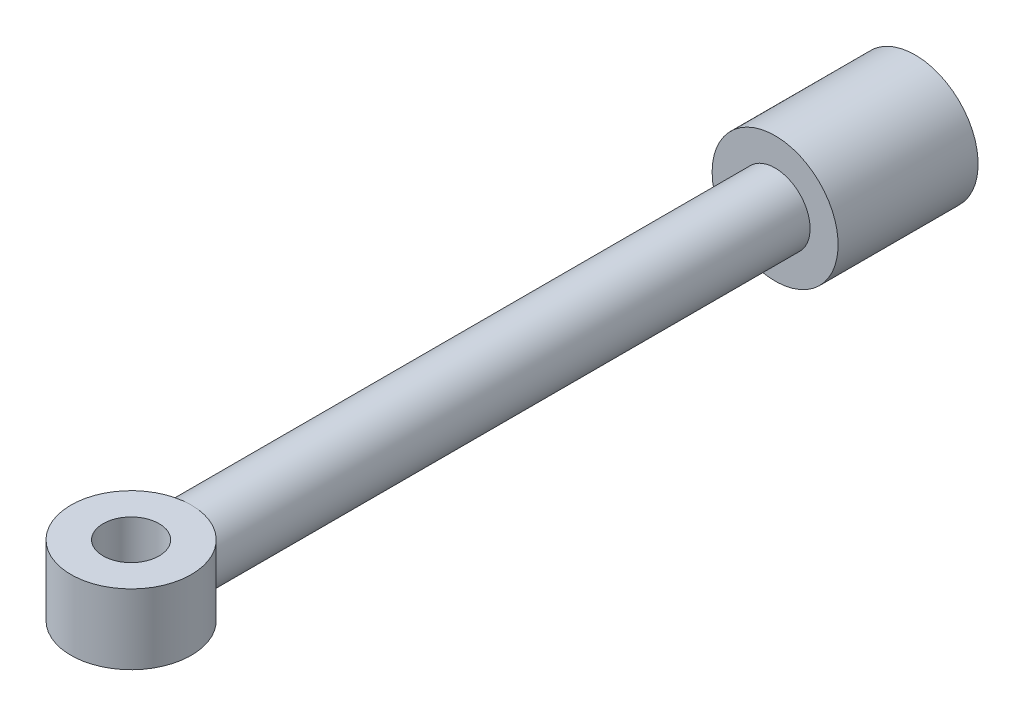
ISO-10303-21;
HEADER;
FILE_DESCRIPTION(('STEP AP214'),'2;1');
FILE_NAME('part.step','',(''),(''),'','','');
FILE_SCHEMA(('AUTOMOTIVE_DESIGN { 1 0 10303 214 1 1 1 1 }'));
ENDSEC;
DATA;
#1=APPLICATION_CONTEXT('core data for automotive mechanical design processes');
#2=APPLICATION_PROTOCOL_DEFINITION('international standard','automotive_design',2000,#1);
#3=PRODUCT_CONTEXT('',#1,'mechanical');
#4=PRODUCT('Part','Part','',(#3));
#5=PRODUCT_RELATED_PRODUCT_CATEGORY('part','',(#4));
#6=PRODUCT_DEFINITION_FORMATION('','',#4);
#7=PRODUCT_DEFINITION_CONTEXT('part definition',#1,'design');
#8=PRODUCT_DEFINITION('design','',#6,#7);
#9=PRODUCT_DEFINITION_SHAPE('','',#8);
#10=(LENGTH_UNIT() NAMED_UNIT(*) SI_UNIT(.MILLI.,.METRE.));
#11=(NAMED_UNIT(*) PLANE_ANGLE_UNIT() SI_UNIT($,.RADIAN.));
#12=(NAMED_UNIT(*) SI_UNIT($,.STERADIAN.) SOLID_ANGLE_UNIT());
#13=UNCERTAINTY_MEASURE_WITH_UNIT(LENGTH_MEASURE(1.E-05),#10,'distance_accuracy_value','');
#14=(GEOMETRIC_REPRESENTATION_CONTEXT(3) GLOBAL_UNCERTAINTY_ASSIGNED_CONTEXT((#13)) GLOBAL_UNIT_ASSIGNED_CONTEXT((#10,
#11,#12)) REPRESENTATION_CONTEXT('',''));
#15=CARTESIAN_POINT('',(0.,0.,0.));
#16=DIRECTION('',(0.,0.,1.));
#17=DIRECTION('',(1.,0.,0.));
#18=AXIS2_PLACEMENT_3D('',#15,#16,#17);
#19=CARTESIAN_POINT('',(0.,0.,75.));
#20=DIRECTION('',(0.,0.,-1.));
#21=DIRECTION('',(-1.,0.,0.));
#22=AXIS2_PLACEMENT_3D('',#19,#20,#21);
#23=CYLINDRICAL_SURFACE('',#22,25.);
#24=CARTESIAN_POINT('',(0.,0.,175.));
#25=DIRECTION('',(0.,0.,-1.));
#26=DIRECTION('',(-1.,0.,0.));
#27=AXIS2_PLACEMENT_3D('',#24,#25,#26);
#28=CIRCLE('',#27,25.);
#29=CARTESIAN_POINT('',(-25.,0.,175.));
#30=VERTEX_POINT('',#29);
#31=EDGE_CURVE('E63',#30,#30,#28,.T.);
#32=ORIENTED_EDGE('',*,*,#31,.F.);
#33=EDGE_LOOP('',(#32));
#34=FACE_BOUND('',#33,.T.);
#35=CARTESIAN_POINT('',(0.,25.,592.));
#36=CARTESIAN_POINT('',(-0.323073219483401,25.0000073405273,591.999991917627));
#37=CARTESIAN_POINT('',(-0.646141502338073,24.9937375418738,592.003640863775));
#38=CARTESIAN_POINT('',(-1.29162001946691,24.9686991510117,592.018192836309));
#39=CARTESIAN_POINT('',(-1.614030273859,24.9499309468376,592.029095637485));
#40=CARTESIAN_POINT('',(-2.25741128983298,24.8999631376806,592.058088437141));
#41=CARTESIAN_POINT('',(-2.57838266443135,24.8687694638436,592.076175006525));
#42=CARTESIAN_POINT('',(-3.21838786165721,24.7940682668799,592.119411054166));
#43=CARTESIAN_POINT('',(-3.53742167778222,24.7505607024509,592.144560556112));
#44=CARTESIAN_POINT('',(-4.48730779691504,24.6022973988042,592.230076116417));
#45=CARTESIAN_POINT('',(-5.11455128542021,24.4795184962339,592.300674658644));
#46=CARTESIAN_POINT('',(-6.35450877170137,24.1873147832337,592.467519884291));
#47=CARTESIAN_POINT('',(-6.96722161414907,24.0178862771203,592.563768599754));
#48=CARTESIAN_POINT('',(-8.17325775073619,23.6346675452906,592.77947806231));
#49=CARTESIAN_POINT('',(-8.76661117389671,23.4209504719296,592.898900512425));
#50=CARTESIAN_POINT('',(-9.93159556183181,22.9512078223228,593.15839840602));
#51=CARTESIAN_POINT('',(-10.5032266492576,22.6951824850066,593.298473732864));
#52=CARTESIAN_POINT('',(-11.6225774564603,22.1428459411344,593.596479530529));
#53=CARTESIAN_POINT('',(-12.1702716259285,21.8464930125045,593.75442846412));
#54=CARTESIAN_POINT('',(-13.2388292536092,21.2159917334919,594.084889987469));
#55=CARTESIAN_POINT('',(-13.7596915345781,20.8818417268222,594.257403215356));
#56=CARTESIAN_POINT('',(-14.8097037618994,20.152189070235,594.626684737254));
#57=CARTESIAN_POINT('',(-15.3366791442554,19.7539876429895,594.824304274079));
#58=CARTESIAN_POINT('',(-16.355570131578,18.9190176170641,595.228204609291));
#59=CARTESIAN_POINT('',(-16.8474842861503,18.4822474245634,595.434485765429));
#60=CARTESIAN_POINT('',(-17.7949550173283,17.5718979612226,595.851465937347));
#61=CARTESIAN_POINT('',(-18.2504761742981,17.0982836954337,596.062169010958));
#62=CARTESIAN_POINT('',(-19.1229526377762,16.1165747091056,596.483155088647));
#63=CARTESIAN_POINT('',(-19.5399059530893,15.6084782106497,596.69343807049));
#64=CARTESIAN_POINT('',(-20.3786164952388,14.4999450687305,597.132326474249));
#65=CARTESIAN_POINT('',(-20.7955295482988,13.8955778996804,597.36029664006));
#66=CARTESIAN_POINT('',(-21.576620180258,12.6487421591043,597.802540616851));
#67=CARTESIAN_POINT('',(-21.9407898478575,12.0062678919936,598.016812370435));
#68=CARTESIAN_POINT('',(-22.6127328991702,10.6869824653494,598.42379930329));
#69=CARTESIAN_POINT('',(-22.9205777197122,10.0102162099254,598.616541665673));
#70=CARTESIAN_POINT('',(-23.4767842757009,8.62536266913672,598.972928714695));
#71=CARTESIAN_POINT('',(-23.7251664515645,7.91728624615682,599.136583395293));
#72=CARTESIAN_POINT('',(-24.1092135452026,6.63955323298848,599.394012848847));
#73=CARTESIAN_POINT('',(-24.2576658880458,6.07520751593122,599.495211205358));
#74=CARTESIAN_POINT('',(-24.5153025535408,4.93376834216409,599.672610024112));
#75=CARTESIAN_POINT('',(-24.624492741889,4.35667680334262,599.74881422029));
#76=CARTESIAN_POINT('',(-24.8021169016052,3.19383705209389,599.873559654141));
#77=CARTESIAN_POINT('',(-24.8705893792807,2.60809755702326,599.922127025787));
#78=CARTESIAN_POINT('',(-24.9659584223035,1.43151915987222,599.989938896084));
#79=CARTESIAN_POINT('',(-24.9928541916902,0.84068016038266,600.009182833357));
#80=CARTESIAN_POINT('',(-25.0046644537355,-0.342553531027862,600.017621374834));
#81=CARTESIAN_POINT('',(-24.9895136493183,-0.934949213713525,600.006769240754));
#82=CARTESIAN_POINT('',(-24.9173247406087,-2.11586738550418,599.95533043359));
#83=CARTESIAN_POINT('',(-24.8602864559335,-2.70438985791871,599.914743632457));
#84=CARTESIAN_POINT('',(-24.705118667433,-3.87365051320268,599.805311753865));
#85=CARTESIAN_POINT('',(-24.6069650173244,-4.45438391452943,599.736450071568));
#86=CARTESIAN_POINT('',(-24.3708826196281,-5.6039678815932,599.572882645657));
#87=CARTESIAN_POINT('',(-24.2329529294205,-6.17281816537928,599.478176289573));
#88=CARTESIAN_POINT('',(-23.9200588841416,-7.29148537237564,599.266736481832));
#89=CARTESIAN_POINT('',(-23.7453650735209,-7.84140893784098,599.150164583484));
#90=CARTESIAN_POINT('',(-23.3599923313202,-8.92418988387641,598.897870163549));
#91=CARTESIAN_POINT('',(-23.149298868061,-9.45704026910448,598.762139912332));
#92=CARTESIAN_POINT('',(-22.693655001516,-10.5035103373492,598.47507028058));
#93=CARTESIAN_POINT('',(-22.4487039520211,-11.017129657374,598.323730605615));
#94=CARTESIAN_POINT('',(-21.9261058615668,-12.0236223707595,598.008934340018));
#95=CARTESIAN_POINT('',(-21.6484550342576,-12.5164933526563,597.845476347004));
#96=CARTESIAN_POINT('',(-21.0133747545136,-13.5598748043819,597.482096451958));
#97=CARTESIAN_POINT('',(-20.6503450688302,-14.1064404244398,597.280614309169));
#98=CARTESIAN_POINT('',(-19.8838315939996,-15.1677892371372,596.870980814586));
#99=CARTESIAN_POINT('',(-19.4803443889607,-15.6825697401703,596.662828900663));
#100=CARTESIAN_POINT('',(-18.6343106730208,-16.6790289504847,596.244544541118));
#101=CARTESIAN_POINT('',(-18.1917279308608,-17.1606762010386,596.034410423032));
#102=CARTESIAN_POINT('',(-17.2695024774644,-18.0884534042603,595.617002238479));
#103=CARTESIAN_POINT('',(-16.7898579259702,-18.5345815910375,595.409728314636));
#104=CARTESIAN_POINT('',(-15.7338572628011,-19.4419172482329,594.977381346595));
#105=CARTESIAN_POINT('',(-15.1528672405291,-19.8982075430565,594.753262732966));
#106=CARTESIAN_POINT('',(-13.9488810741164,-20.7599803780785,594.320300022891));
#107=CARTESIAN_POINT('',(-13.3258810956641,-21.1654582708726,594.111457324338));
#108=CARTESIAN_POINT('',(-12.0423003328998,-21.9211449030045,593.715217486015));
#109=CARTESIAN_POINT('',(-11.3817895732271,-22.2714523003018,593.527782233517));
#110=CARTESIAN_POINT('',(-10.0262438133686,-22.9136791762596,593.179384301884));
#111=CARTESIAN_POINT('',(-9.33121177846102,-23.2056036590542,593.018419354127));
#112=CARTESIAN_POINT('',(-7.94372462011018,-23.7153694620421,592.734458317691));
#113=CARTESIAN_POINT('',(-7.25255984764809,-23.935952478089,592.610080026113));
#114=CARTESIAN_POINT('',(-5.84882965497463,-24.3170639383683,592.393722450943));
#115=CARTESIAN_POINT('',(-5.13626793238094,-24.4776026950914,592.301737603995));
#116=CARTESIAN_POINT('',(-4.05369539716517,-24.671920503785,592.189943321607));
#117=CARTESIAN_POINT('',(-3.68905733973752,-24.7290793691959,592.156963391952));
#118=CARTESIAN_POINT('',(-2.9568704320822,-24.8272688018788,592.100213911025));
#119=CARTESIAN_POINT('',(-2.58932160100161,-24.8682994751525,592.076444299219));
#120=CARTESIAN_POINT('',(-1.85197952858847,-24.9340583440999,592.0383134043));
#121=CARTESIAN_POINT('',(-1.48218467381488,-24.9587729425175,592.023959968366));
#122=CARTESIAN_POINT('',(-0.741596033911648,-24.9917505720782,592.004796005514));
#123=CARTESIAN_POINT('',(-0.370802195670502,-25.000012710516,591.999985996419));
#124=CARTESIAN_POINT('',(0.,-25.,592.));
#125=B_SPLINE_CURVE_WITH_KNOTS('',3,(#35,#36,#37,#38,#39,#40,#41,#42,#43,#44,#45,#46,#47,#48,
#49,#50,#51,#52,#53,#54,#55,#56,#57,#58,#59,#60,#61,#62,#63,#64,#65,#66,#67,#68,#69,#70,#71,#72,
#73,#74,#75,#76,#77,#78,#79,#80,#81,#82,#83,#84,#85,#86,#87,#88,#89,#90,#91,#92,#93,#94,#95,#96,
#97,#98,#99,#100,#101,#102,#103,#104,#105,#106,#107,#108,#109,#110,#111,#112,#113,#114,#115,
#116,#117,#118,#119,#120,#121,#122,#123,#124),.UNSPECIFIED.,.F.,.F.,(4,2,2,2,2,2,2,2,2,2,2,2,2,
2,2,2,2,2,2,2,2,2,2,2,2,2,2,2,2,2,2,2,2,2,2,2,2,2,2,2,2,2,2,2,4),(0.,0.969129286855343,
1.9382284868321,2.90686565243429,3.87550606700364,5.80196075601255,7.72856810690568,
9.65201824772571,11.5754575265228,13.500902102308,15.4264310847567,17.4926341354823,
19.5589226102521,21.6271982123862,23.695580536709,25.9991410406335,28.303046712491,
30.6040097719282,32.9041807307745,34.6791412126934,36.4538364083727,38.2268506135154,
39.9998987615087,41.775701940575,43.551512766942,45.3283679591154,47.1052652629894,
48.8695171920972,50.6344829718385,52.3994820490406,54.1646856990844,56.2217681123882,
58.2790243548663,60.3382075449278,62.3974930469429,64.7105585581636,67.0238354728348,
69.3329275414591,71.6418216075804,73.8468588699269,76.0515172471042,77.1628077730092,
78.2740909949048,79.3862991569077,80.4985676653297),.UNSPECIFIED.);
#126=CARTESIAN_POINT('',(0.,25.,592.));
#127=VERTEX_POINT('',#126);
#128=CARTESIAN_POINT('',(0.,-25.,592.));
#129=VERTEX_POINT('',#128);
#130=EDGE_CURVE('E52',#127,#129,#125,.T.);
#131=ORIENTED_EDGE('',*,*,#130,.F.);
#132=CARTESIAN_POINT('',(0.,-25.,592.));
#133=CARTESIAN_POINT('',(0.323073219483533,-25.0000073405273,591.999991917627));
#134=CARTESIAN_POINT('',(0.646141502338204,-24.9937375418738,592.003640863775));
#135=CARTESIAN_POINT('',(1.29162001946704,-24.9686991510117,592.018192836309));
#136=CARTESIAN_POINT('',(1.61403027385913,-24.9499309468376,592.029095637485));
#137=CARTESIAN_POINT('',(2.25741128983311,-24.8999631376806,592.058088437141));
#138=CARTESIAN_POINT('',(2.57838266443147,-24.8687694638436,592.076175006525));
#139=CARTESIAN_POINT('',(3.21838786165733,-24.7940682668799,592.119411054166));
#140=CARTESIAN_POINT('',(3.53742167778236,-24.7505607024509,592.144560556112));
#141=CARTESIAN_POINT('',(4.48730779691518,-24.6022973988042,592.230076116417));
#142=CARTESIAN_POINT('',(5.11455128542035,-24.4795184962339,592.300674658644));
#143=CARTESIAN_POINT('',(6.35450877170151,-24.1873147832337,592.467519884291));
#144=CARTESIAN_POINT('',(6.96722161414921,-24.0178862771203,592.563768599754));
#145=CARTESIAN_POINT('',(8.17325775073634,-23.6346675452906,592.77947806231));
#146=CARTESIAN_POINT('',(8.76661117389688,-23.4209504719296,592.898900512425));
#147=CARTESIAN_POINT('',(9.93159556183199,-22.9512078223228,593.15839840602));
#148=CARTESIAN_POINT('',(10.5032266492578,-22.6951824850066,593.298473732864));
#149=CARTESIAN_POINT('',(11.6225774564605,-22.1428459411344,593.596479530529));
#150=CARTESIAN_POINT('',(12.1702716259287,-21.8464930125044,593.75442846412));
#151=CARTESIAN_POINT('',(13.2388292536094,-21.2159917334919,594.084889987469));
#152=CARTESIAN_POINT('',(13.7596915345782,-20.8818417268222,594.257403215356));
#153=CARTESIAN_POINT('',(14.8097037618995,-20.152189070235,594.626684737254));
#154=CARTESIAN_POINT('',(15.3366791442556,-19.7539876429894,594.824304274079));
#155=CARTESIAN_POINT('',(16.3555701315782,-18.9190176170641,595.228204609291));
#156=CARTESIAN_POINT('',(16.8474842861504,-18.4822474245634,595.434485765429));
#157=CARTESIAN_POINT('',(17.7949550173284,-17.5718979612226,595.851465937347));
#158=CARTESIAN_POINT('',(18.2504761742982,-17.0982836954337,596.062169010958));
#159=CARTESIAN_POINT('',(19.1229526377764,-16.1165747091056,596.483155088647));
#160=CARTESIAN_POINT('',(19.5399059530895,-15.6084782106497,596.69343807049));
#161=CARTESIAN_POINT('',(20.378616495239,-14.4999450687305,597.132326474249));
#162=CARTESIAN_POINT('',(20.795529548299,-13.8955778996803,597.36029664006));
#163=CARTESIAN_POINT('',(21.5766201802581,-12.6487421591043,597.802540616851));
#164=CARTESIAN_POINT('',(21.9407898478576,-12.0062678919936,598.016812370435));
#165=CARTESIAN_POINT('',(22.6127328991703,-10.6869824653494,598.42379930329));
#166=CARTESIAN_POINT('',(22.9205777197123,-10.0102162099253,598.616541665673));
#167=CARTESIAN_POINT('',(23.4767842757011,-8.6253626691367,598.972928714695));
#168=CARTESIAN_POINT('',(23.7251664515646,-7.9172862461568,599.136583395293));
#169=CARTESIAN_POINT('',(24.1092135452027,-6.63955323298846,599.394012848847));
#170=CARTESIAN_POINT('',(24.2576658880459,-6.07520751593121,599.495211205358));
#171=CARTESIAN_POINT('',(24.5153025535409,-4.93376834216407,599.672610024112));
#172=CARTESIAN_POINT('',(24.6244927418891,-4.35667680334259,599.74881422029));
#173=CARTESIAN_POINT('',(24.8021169016054,-3.19383705209387,599.873559654141));
#174=CARTESIAN_POINT('',(24.8705893792809,-2.60809755702324,599.922127025787));
#175=CARTESIAN_POINT('',(24.9659584223036,-1.4315191598722,599.989938896084));
#176=CARTESIAN_POINT('',(24.9928541916903,-0.840680160382639,600.009182833357));
#177=CARTESIAN_POINT('',(25.0046644537356,0.342553531027885,600.017621374834));
#178=CARTESIAN_POINT('',(24.9895136493184,0.934949213713546,600.006769240754));
#179=CARTESIAN_POINT('',(24.9173247406088,2.1158673855042,599.95533043359));
#180=CARTESIAN_POINT('',(24.8602864559336,2.70438985791873,599.914743632457));
#181=CARTESIAN_POINT('',(24.7051186674332,3.8736505132027,599.805311753865));
#182=CARTESIAN_POINT('',(24.6069650173246,4.45438391452945,599.736450071568));
#183=CARTESIAN_POINT('',(24.3708826196282,5.60396788159322,599.572882645657));
#184=CARTESIAN_POINT('',(24.2329529294206,6.1728181653793,599.478176289573));
#185=CARTESIAN_POINT('',(23.9200588841418,7.29148537237566,599.266736481832));
#186=CARTESIAN_POINT('',(23.745365073521,7.84140893784099,599.150164583484));
#187=CARTESIAN_POINT('',(23.3599923313203,8.92418988387642,598.897870163549));
#188=CARTESIAN_POINT('',(23.1492988680612,9.4570402691045,598.762139912332));
#189=CARTESIAN_POINT('',(22.6936550015161,10.5035103373492,598.47507028058));
#190=CARTESIAN_POINT('',(22.4487039520212,11.017129657374,598.323730605615));
#191=CARTESIAN_POINT('',(21.9261058615669,12.0236223707595,598.008934340018));
#192=CARTESIAN_POINT('',(21.6484550342578,12.5164933526563,597.845476347004));
#193=CARTESIAN_POINT('',(21.0133747545137,13.5598748043819,597.482096451958));
#194=CARTESIAN_POINT('',(20.6503450688303,14.1064404244398,597.280614309169));
#195=CARTESIAN_POINT('',(19.8838315939997,15.1677892371372,596.870980814586));
#196=CARTESIAN_POINT('',(19.4803443889608,15.6825697401703,596.662828900663));
#197=CARTESIAN_POINT('',(18.6343106730209,16.6790289504848,596.244544541118));
#198=CARTESIAN_POINT('',(18.1917279308609,17.1606762010386,596.034410423032));
#199=CARTESIAN_POINT('',(17.2695024774645,18.0884534042603,595.617002238479));
#200=CARTESIAN_POINT('',(16.7898579259703,18.5345815910375,595.409728314636));
#201=CARTESIAN_POINT('',(15.7338572628012,19.4419172482329,594.977381346595));
#202=CARTESIAN_POINT('',(15.1528672405293,19.8982075430565,594.753262732966));
#203=CARTESIAN_POINT('',(13.9488810741165,20.7599803780785,594.320300022891));
#204=CARTESIAN_POINT('',(13.3258810956642,21.1654582708726,594.111457324338));
#205=CARTESIAN_POINT('',(12.0423003328999,21.9211449030045,593.715217486015));
#206=CARTESIAN_POINT('',(11.3817895732272,22.2714523003018,593.527782233517));
#207=CARTESIAN_POINT('',(10.0262438133687,22.9136791762597,593.179384301884));
#208=CARTESIAN_POINT('',(9.33121177846112,23.2056036590542,593.018419354127));
#209=CARTESIAN_POINT('',(7.94372462011028,23.7153694620421,592.734458317691));
#210=CARTESIAN_POINT('',(7.25255984764819,23.935952478089,592.610080026113));
#211=CARTESIAN_POINT('',(5.84882965497474,24.3170639383683,592.393722450943));
#212=CARTESIAN_POINT('',(5.13626793238105,24.4776026950914,592.301737603995));
#213=CARTESIAN_POINT('',(4.05369539716529,24.671920503785,592.189943321607));
#214=CARTESIAN_POINT('',(3.68905733973764,24.7290793691959,592.156963391952));
#215=CARTESIAN_POINT('',(2.95687043208232,24.8272688018788,592.100213911025));
#216=CARTESIAN_POINT('',(2.58932160100173,24.8682994751525,592.076444299219));
#217=CARTESIAN_POINT('',(1.85197952858859,24.9340583440999,592.0383134043));
#218=CARTESIAN_POINT('',(1.482184673815,24.9587729425175,592.023959968366));
#219=CARTESIAN_POINT('',(0.741596033911774,24.9917505720782,592.004796005514));
#220=CARTESIAN_POINT('',(0.370802195670628,25.000012710516,591.999985996419));
#221=CARTESIAN_POINT('',(0.,25.,592.));
#222=B_SPLINE_CURVE_WITH_KNOTS('',3,(#132,#133,#134,#135,#136,#137,#138,#139,#140,#141,#142,
#143,#144,#145,#146,#147,#148,#149,#150,#151,#152,#153,#154,#155,#156,#157,#158,#159,#160,#161,
#162,#163,#164,#165,#166,#167,#168,#169,#170,#171,#172,#173,#174,#175,#176,#177,#178,#179,#180,
#181,#182,#183,#184,#185,#186,#187,#188,#189,#190,#191,#192,#193,#194,#195,#196,#197,#198,#199,
#200,#201,#202,#203,#204,#205,#206,#207,#208,#209,#210,#211,#212,#213,#214,#215,#216,#217,#218,
#219,#220,#221),.UNSPECIFIED.,.F.,.F.,(4,2,2,2,2,2,2,2,2,2,2,2,2,2,2,2,2,2,2,2,2,2,2,2,2,2,2,2,
2,2,2,2,2,2,2,2,2,2,2,2,2,2,2,2,4),(0.,0.969129286855343,1.93822848683209,2.90686565243428,
3.87550606700364,5.80196075601256,7.72856810690569,9.65201824772576,11.5754575265229,
13.500902102308,15.4264310847567,17.4926341354823,19.5589226102521,21.6271982123862,
23.6955805367091,25.9991410406336,28.3030467124911,30.6040097719282,32.9041807307745,
34.6791412126934,36.4538364083727,38.2268506135154,39.9998987615087,41.775701940575,
43.5515127669421,45.3283679591154,47.1052652629895,48.8695171920973,50.6344829718385,
52.3994820490406,54.1646856990844,56.2217681123882,58.2790243548663,60.3382075449279,
62.397493046943,64.7105585581636,67.0238354728349,69.3329275414592,71.6418216075805,
73.846858869927,76.0515172471042,77.1628077730092,78.2740909949048,79.3862991569077,
80.4985676653297),.UNSPECIFIED.);
#223=EDGE_CURVE('E55',#129,#127,#222,.T.);
#224=ORIENTED_EDGE('',*,*,#223,.F.);
#225=EDGE_LOOP('',(#131,#224));
#226=FACE_BOUND('',#225,.T.);
#227=ADVANCED_FACE('F37',(#34,#226),#23,.T.);
#228=CARTESIAN_POINT('',(0.,0.,75.));
#229=DIRECTION('',(0.,0.,1.));
#230=DIRECTION('',(1.,0.,0.));
#231=AXIS2_PLACEMENT_3D('',#228,#229,#230);
#232=PLANE('',#231);
#233=CARTESIAN_POINT('',(0.,0.,75.));
#234=DIRECTION('',(0.,0.,-1.));
#235=DIRECTION('',(-1.,0.,0.));
#236=AXIS2_PLACEMENT_3D('',#233,#234,#235);
#237=CIRCLE('',#236,45.);
#238=CARTESIAN_POINT('',(-45.,0.,75.));
#239=VERTEX_POINT('',#238);
#240=EDGE_CURVE('E11',#239,#239,#237,.T.);
#241=ORIENTED_EDGE('',*,*,#240,.T.);
#242=EDGE_LOOP('',(#241));
#243=FACE_BOUND('',#242,.T.);
#244=ADVANCED_FACE('F39',(#243),#232,.F.);
#245=CARTESIAN_POINT('',(0.,0.,75.));
#246=DIRECTION('',(0.,0.,-1.));
#247=DIRECTION('',(-1.,0.,0.));
#248=AXIS2_PLACEMENT_3D('',#245,#246,#247);
#249=CYLINDRICAL_SURFACE('',#248,45.);
#250=ORIENTED_EDGE('',*,*,#240,.F.);
#251=EDGE_LOOP('',(#250));
#252=FACE_BOUND('',#251,.T.);
#253=CARTESIAN_POINT('',(0.,0.,175.));
#254=DIRECTION('',(0.,0.,-1.));
#255=DIRECTION('',(-1.,0.,0.));
#256=AXIS2_PLACEMENT_3D('',#253,#254,#255);
#257=CIRCLE('',#256,45.);
#258=CARTESIAN_POINT('',(-45.,0.,175.));
#259=VERTEX_POINT('',#258);
#260=EDGE_CURVE('E45',#259,#259,#257,.T.);
#261=ORIENTED_EDGE('',*,*,#260,.T.);
#262=EDGE_LOOP('',(#261));
#263=FACE_BOUND('',#262,.T.);
#264=ADVANCED_FACE('F110',(#252,#263),#249,.T.);
#265=CARTESIAN_POINT('',(45.,0.,175.));
#266=DIRECTION('',(0.,0.,-1.));
#267=DIRECTION('',(-1.,0.,0.));
#268=AXIS2_PLACEMENT_3D('',#265,#266,#267);
#269=PLANE('',#268);
#270=ORIENTED_EDGE('',*,*,#260,.F.);
#271=EDGE_LOOP('',(#270));
#272=FACE_BOUND('',#271,.T.);
#273=ORIENTED_EDGE('',*,*,#31,.T.);
#274=EDGE_LOOP('',(#273));
#275=FACE_BOUND('',#274,.T.);
#276=ADVANCED_FACE('F90',(#272,#275),#269,.F.);
#277=CARTESIAN_POINT('',(0.,25.,635.));
#278=DIRECTION('',(0.,-1.,0.));
#279=DIRECTION('',(0.,0.,-1.));
#280=AXIS2_PLACEMENT_3D('',#277,#278,#279);
#281=CYLINDRICAL_SURFACE('',#280,43.);
#282=CARTESIAN_POINT('',(0.,25.,635.));
#283=DIRECTION('',(0.,1.,0.));
#284=DIRECTION('',(0.,0.,1.));
#285=AXIS2_PLACEMENT_3D('',#282,#283,#284);
#286=CIRCLE('',#285,43.);
#287=EDGE_CURVE('E58',#127,#127,#286,.T.);
#288=ORIENTED_EDGE('',*,*,#287,.F.);
#289=ORIENTED_EDGE('',*,*,#130,.T.);
#290=CARTESIAN_POINT('',(0.,-25.,635.));
#291=DIRECTION('',(0.,1.,0.));
#292=DIRECTION('',(0.,0.,1.));
#293=AXIS2_PLACEMENT_3D('',#290,#291,#292);
#294=CIRCLE('',#293,43.);
#295=EDGE_CURVE('E60',#129,#129,#294,.T.);
#296=ORIENTED_EDGE('',*,*,#295,.T.);
#297=ORIENTED_EDGE('',*,*,#223,.T.);
#298=EDGE_LOOP('',(#288,#289,#296,#297));
#299=FACE_BOUND('',#298,.T.);
#300=ADVANCED_FACE('F56',(#299),#281,.T.);
#301=CARTESIAN_POINT('',(0.,25.,635.));
#302=DIRECTION('',(0.,1.,0.));
#303=DIRECTION('',(0.,0.,1.));
#304=AXIS2_PLACEMENT_3D('',#301,#302,#303);
#305=PLANE('',#304);
#306=ORIENTED_EDGE('',*,*,#287,.T.);
#307=EDGE_LOOP('',(#306));
#308=FACE_BOUND('',#307,.T.);
#309=CARTESIAN_POINT('',(0.,25.,635.));
#310=DIRECTION('',(0.,1.,0.));
#311=DIRECTION('',(0.,0.,1.));
#312=AXIS2_PLACEMENT_3D('',#309,#310,#311);
#313=CIRCLE('',#312,20.);
#314=CARTESIAN_POINT('',(0.,25.,655.));
#315=VERTEX_POINT('',#314);
#316=EDGE_CURVE('E69',#315,#315,#313,.T.);
#317=ORIENTED_EDGE('',*,*,#316,.F.);
#318=EDGE_LOOP('',(#317));
#319=FACE_BOUND('',#318,.T.);
#320=ADVANCED_FACE('F66',(#308,#319),#305,.T.);
#321=CARTESIAN_POINT('',(0.,-25.,635.));
#322=DIRECTION('',(0.,1.,0.));
#323=DIRECTION('',(0.,0.,1.));
#324=AXIS2_PLACEMENT_3D('',#321,#322,#323);
#325=PLANE('',#324);
#326=ORIENTED_EDGE('',*,*,#295,.F.);
#327=EDGE_LOOP('',(#326));
#328=FACE_BOUND('',#327,.T.);
#329=CARTESIAN_POINT('',(0.,-25.,635.));
#330=DIRECTION('',(0.,1.,0.));
#331=DIRECTION('',(0.,0.,1.));
#332=AXIS2_PLACEMENT_3D('',#329,#330,#331);
#333=CIRCLE('',#332,20.);
#334=CARTESIAN_POINT('',(0.,-25.,655.));
#335=VERTEX_POINT('',#334);
#336=EDGE_CURVE('E72',#335,#335,#333,.T.);
#337=ORIENTED_EDGE('',*,*,#336,.T.);
#338=EDGE_LOOP('',(#337));
#339=FACE_BOUND('',#338,.T.);
#340=ADVANCED_FACE('F91',(#328,#339),#325,.F.);
#341=CARTESIAN_POINT('',(0.,25.,635.));
#342=DIRECTION('',(0.,-1.,0.));
#343=DIRECTION('',(0.,0.,-1.));
#344=AXIS2_PLACEMENT_3D('',#341,#342,#343);
#345=CYLINDRICAL_SURFACE('',#344,20.);
#346=ORIENTED_EDGE('',*,*,#316,.T.);
#347=EDGE_LOOP('',(#346));
#348=FACE_BOUND('',#347,.T.);
#349=ORIENTED_EDGE('',*,*,#336,.F.);
#350=EDGE_LOOP('',(#349));
#351=FACE_BOUND('',#350,.T.);
#352=ADVANCED_FACE('F95',(#348,#351),#345,.F.);
#353=CLOSED_SHELL('',(#227,#244,#264,#276,#300,#320,#340,#352));
#354=MANIFOLD_SOLID_BREP('B2',#353);
#355=ADVANCED_BREP_SHAPE_REPRESENTATION('',(#18,#354),#14);
#356=SHAPE_DEFINITION_REPRESENTATION(#9,#355);
ENDSEC;
END-ISO-10303-21;
